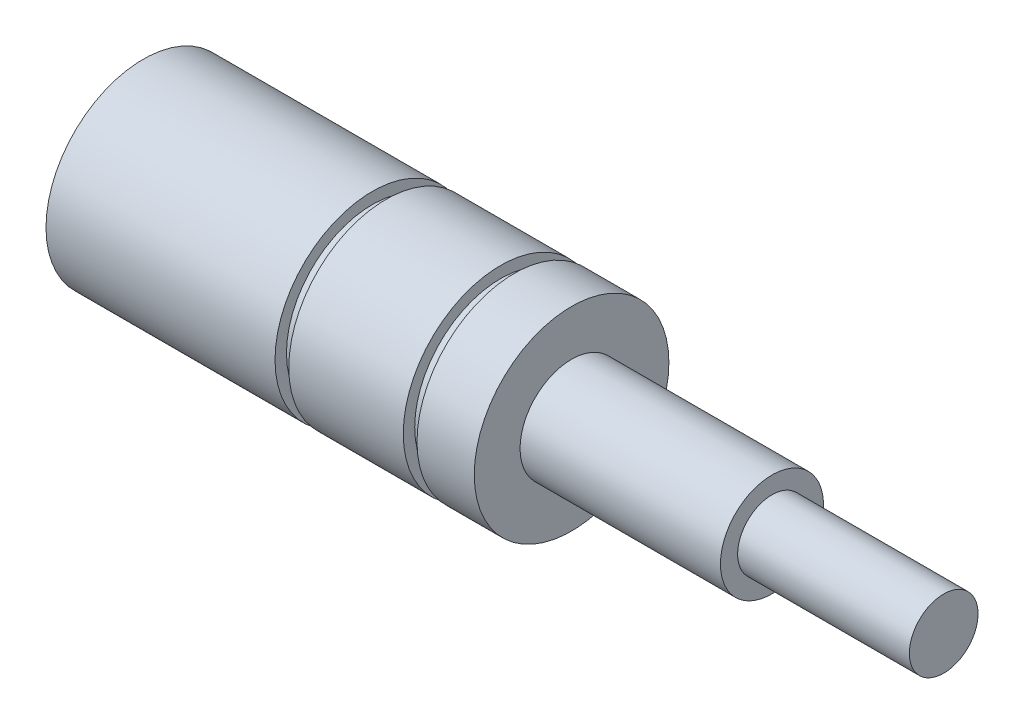
ISO-10303-21;
HEADER;
FILE_DESCRIPTION(('STEP AP214'),'2;1');
FILE_NAME('part.step','',(''),(''),'','','');
FILE_SCHEMA(('AUTOMOTIVE_DESIGN { 1 0 10303 214 1 1 1 1 }'));
ENDSEC;
DATA;
#1=APPLICATION_CONTEXT('core data for automotive mechanical design processes');
#2=APPLICATION_PROTOCOL_DEFINITION('international standard','automotive_design',2000,#1);
#3=PRODUCT_CONTEXT('',#1,'mechanical');
#4=PRODUCT('Part','Part','',(#3));
#5=PRODUCT_RELATED_PRODUCT_CATEGORY('part','',(#4));
#6=PRODUCT_DEFINITION_FORMATION('','',#4);
#7=PRODUCT_DEFINITION_CONTEXT('part definition',#1,'design');
#8=PRODUCT_DEFINITION('design','',#6,#7);
#9=PRODUCT_DEFINITION_SHAPE('','',#8);
#10=(LENGTH_UNIT() NAMED_UNIT(*) SI_UNIT(.MILLI.,.METRE.));
#11=(NAMED_UNIT(*) PLANE_ANGLE_UNIT() SI_UNIT($,.RADIAN.));
#12=(NAMED_UNIT(*) SI_UNIT($,.STERADIAN.) SOLID_ANGLE_UNIT());
#13=UNCERTAINTY_MEASURE_WITH_UNIT(LENGTH_MEASURE(1.E-05),#10,'distance_accuracy_value','');
#14=(GEOMETRIC_REPRESENTATION_CONTEXT(3) GLOBAL_UNCERTAINTY_ASSIGNED_CONTEXT((#13)) GLOBAL_UNIT_ASSIGNED_CONTEXT((#10,
#11,#12)) REPRESENTATION_CONTEXT('',''));
#15=CARTESIAN_POINT('',(0.,0.,0.));
#16=DIRECTION('',(0.,0.,1.));
#17=DIRECTION('',(1.,0.,0.));
#18=AXIS2_PLACEMENT_3D('',#15,#16,#17);
#19=CARTESIAN_POINT('',(-21.4,8.5,0.));
#20=DIRECTION('',(1.,0.,0.));
#21=DIRECTION('',(0.,0.,-1.));
#22=AXIS2_PLACEMENT_3D('',#19,#20,#21);
#23=PLANE('',#22);
#24=CARTESIAN_POINT('',(-21.4,0.,0.));
#25=DIRECTION('',(-1.,0.,0.));
#26=DIRECTION('',(0.,0.,1.));
#27=AXIS2_PLACEMENT_3D('',#24,#25,#26);
#28=CIRCLE('',#27,4.5);
#29=CARTESIAN_POINT('',(-21.4,0.,4.5));
#30=VERTEX_POINT('',#29);
#31=EDGE_CURVE('E10',#30,#30,#28,.T.);
#32=ORIENTED_EDGE('',*,*,#31,.F.);
#33=EDGE_LOOP('',(#32));
#34=FACE_BOUND('',#33,.T.);
#35=CARTESIAN_POINT('',(-21.4,0.,0.));
#36=DIRECTION('',(-1.,0.,0.));
#37=DIRECTION('',(0.,0.,1.));
#38=AXIS2_PLACEMENT_3D('',#35,#36,#37);
#39=CIRCLE('',#38,8.5);
#40=CARTESIAN_POINT('',(-21.4,0.,8.5));
#41=VERTEX_POINT('',#40);
#42=EDGE_CURVE('E104',#41,#41,#39,.T.);
#43=ORIENTED_EDGE('',*,*,#42,.T.);
#44=EDGE_LOOP('',(#43));
#45=FACE_BOUND('',#44,.T.);
#46=ADVANCED_FACE('F37',(#34,#45),#23,.F.);
#47=CARTESIAN_POINT('',(-48.5100507344483,0.,0.));
#48=DIRECTION('',(-1.,0.,0.));
#49=DIRECTION('',(0.,0.,1.));
#50=AXIS2_PLACEMENT_3D('',#47,#48,#49);
#51=CYLINDRICAL_SURFACE('',#50,4.5);
#52=CARTESIAN_POINT('',(0.,0.,0.));
#53=DIRECTION('',(-1.,0.,0.));
#54=DIRECTION('',(0.,0.,1.));
#55=AXIS2_PLACEMENT_3D('',#52,#53,#54);
#56=CIRCLE('',#55,4.5);
#57=CARTESIAN_POINT('',(0.,0.,4.5));
#58=VERTEX_POINT('',#57);
#59=EDGE_CURVE('E44',#58,#58,#56,.T.);
#60=ORIENTED_EDGE('',*,*,#59,.F.);
#61=EDGE_LOOP('',(#60));
#62=FACE_BOUND('',#61,.T.);
#63=ORIENTED_EDGE('',*,*,#31,.T.);
#64=EDGE_LOOP('',(#63));
#65=FACE_BOUND('',#64,.T.);
#66=ADVANCED_FACE('F195',(#62,#65),#51,.F.);
#67=CARTESIAN_POINT('',(0.,4.5,0.));
#68=DIRECTION('',(1.,0.,0.));
#69=DIRECTION('',(0.,0.,-1.));
#70=AXIS2_PLACEMENT_3D('',#67,#68,#69);
#71=PLANE('',#70);
#72=ORIENTED_EDGE('',*,*,#59,.T.);
#73=EDGE_LOOP('',(#72));
#74=FACE_BOUND('',#73,.T.);
#75=ADVANCED_FACE('F190',(#74),#71,.F.);
#76=CARTESIAN_POINT('',(48.5,0.,0.));
#77=DIRECTION('',(-1.,0.,0.));
#78=DIRECTION('',(0.,0.,1.));
#79=AXIS2_PLACEMENT_3D('',#76,#77,#78);
#80=PLANE('',#79);
#81=CARTESIAN_POINT('',(48.5,0.,0.));
#82=DIRECTION('',(-1.,0.,0.));
#83=DIRECTION('',(0.,0.,1.));
#84=AXIS2_PLACEMENT_3D('',#81,#82,#83);
#85=CIRCLE('',#84,3.);
#86=CARTESIAN_POINT('',(48.5,0.,3.));
#87=VERTEX_POINT('',#86);
#88=EDGE_CURVE('E49',#87,#87,#85,.T.);
#89=ORIENTED_EDGE('',*,*,#88,.F.);
#90=EDGE_LOOP('',(#89));
#91=FACE_BOUND('',#90,.T.);
#92=ADVANCED_FACE('F185',(#91),#80,.F.);
#93=CARTESIAN_POINT('',(-48.5100507344483,0.,0.));
#94=DIRECTION('',(-1.,0.,0.));
#95=DIRECTION('',(0.,0.,1.));
#96=AXIS2_PLACEMENT_3D('',#93,#94,#95);
#97=CYLINDRICAL_SURFACE('',#96,3.);
#98=CARTESIAN_POINT('',(33.5,0.,0.));
#99=DIRECTION('',(-1.,0.,0.));
#100=DIRECTION('',(0.,0.,1.));
#101=AXIS2_PLACEMENT_3D('',#98,#99,#100);
#102=CIRCLE('',#101,3.);
#103=CARTESIAN_POINT('',(33.5,0.,3.));
#104=VERTEX_POINT('',#103);
#105=EDGE_CURVE('E54',#104,#104,#102,.T.);
#106=ORIENTED_EDGE('',*,*,#105,.F.);
#107=EDGE_LOOP('',(#106));
#108=FACE_BOUND('',#107,.T.);
#109=ORIENTED_EDGE('',*,*,#88,.T.);
#110=EDGE_LOOP('',(#109));
#111=FACE_BOUND('',#110,.T.);
#112=ADVANCED_FACE('F179',(#108,#111),#97,.T.);
#113=CARTESIAN_POINT('',(33.5,3.,0.));
#114=DIRECTION('',(-1.,0.,0.));
#115=DIRECTION('',(0.,0.,1.));
#116=AXIS2_PLACEMENT_3D('',#113,#114,#115);
#117=PLANE('',#116);
#118=CARTESIAN_POINT('',(33.5,0.,0.));
#119=DIRECTION('',(-1.,0.,0.));
#120=DIRECTION('',(0.,0.,1.));
#121=AXIS2_PLACEMENT_3D('',#118,#119,#120);
#122=CIRCLE('',#121,4.5);
#123=CARTESIAN_POINT('',(33.5,0.,4.5));
#124=VERTEX_POINT('',#123);
#125=EDGE_CURVE('E60',#124,#124,#122,.T.);
#126=ORIENTED_EDGE('',*,*,#125,.F.);
#127=EDGE_LOOP('',(#126));
#128=FACE_BOUND('',#127,.T.);
#129=ORIENTED_EDGE('',*,*,#105,.T.);
#130=EDGE_LOOP('',(#129));
#131=FACE_BOUND('',#130,.T.);
#132=ADVANCED_FACE('F173',(#128,#131),#117,.F.);
#133=CARTESIAN_POINT('',(-48.5100507344483,0.,0.));
#134=DIRECTION('',(-1.,0.,0.));
#135=DIRECTION('',(0.,0.,1.));
#136=AXIS2_PLACEMENT_3D('',#133,#134,#135);
#137=CYLINDRICAL_SURFACE('',#136,4.5);
#138=CARTESIAN_POINT('',(16.,0.,0.));
#139=DIRECTION('',(-1.,0.,0.));
#140=DIRECTION('',(0.,0.,1.));
#141=AXIS2_PLACEMENT_3D('',#138,#139,#140);
#142=CIRCLE('',#141,4.5);
#143=CARTESIAN_POINT('',(16.,0.,4.5));
#144=VERTEX_POINT('',#143);
#145=EDGE_CURVE('E64',#144,#144,#142,.T.);
#146=ORIENTED_EDGE('',*,*,#145,.F.);
#147=EDGE_LOOP('',(#146));
#148=FACE_BOUND('',#147,.T.);
#149=ORIENTED_EDGE('',*,*,#125,.T.);
#150=EDGE_LOOP('',(#149));
#151=FACE_BOUND('',#150,.T.);
#152=ADVANCED_FACE('F167',(#148,#151),#137,.T.);
#153=CARTESIAN_POINT('',(16.,4.5,0.));
#154=DIRECTION('',(-1.,0.,0.));
#155=DIRECTION('',(0.,0.,1.));
#156=AXIS2_PLACEMENT_3D('',#153,#154,#155);
#157=PLANE('',#156);
#158=CARTESIAN_POINT('',(16.,0.,0.));
#159=DIRECTION('',(-1.,0.,0.));
#160=DIRECTION('',(0.,0.,1.));
#161=AXIS2_PLACEMENT_3D('',#158,#159,#160);
#162=CIRCLE('',#161,8.5);
#163=CARTESIAN_POINT('',(16.,0.,8.5));
#164=VERTEX_POINT('',#163);
#165=EDGE_CURVE('E68',#164,#164,#162,.T.);
#166=ORIENTED_EDGE('',*,*,#165,.F.);
#167=EDGE_LOOP('',(#166));
#168=FACE_BOUND('',#167,.T.);
#169=ORIENTED_EDGE('',*,*,#145,.T.);
#170=EDGE_LOOP('',(#169));
#171=FACE_BOUND('',#170,.T.);
#172=ADVANCED_FACE('F161',(#168,#171),#157,.F.);
#173=CARTESIAN_POINT('',(-48.5100507344483,0.,0.));
#174=DIRECTION('',(-1.,0.,0.));
#175=DIRECTION('',(0.,0.,1.));
#176=AXIS2_PLACEMENT_3D('',#173,#174,#175);
#177=CYLINDRICAL_SURFACE('',#176,8.5);
#178=CARTESIAN_POINT('',(11.,0.,0.));
#179=DIRECTION('',(-1.,0.,0.));
#180=DIRECTION('',(0.,0.,1.));
#181=AXIS2_PLACEMENT_3D('',#178,#179,#180);
#182=CIRCLE('',#181,8.5);
#183=CARTESIAN_POINT('',(11.,0.,8.5));
#184=VERTEX_POINT('',#183);
#185=EDGE_CURVE('E72',#184,#184,#182,.T.);
#186=ORIENTED_EDGE('',*,*,#185,.F.);
#187=EDGE_LOOP('',(#186));
#188=FACE_BOUND('',#187,.T.);
#189=ORIENTED_EDGE('',*,*,#165,.T.);
#190=EDGE_LOOP('',(#189));
#191=FACE_BOUND('',#190,.T.);
#192=ADVANCED_FACE('F155',(#188,#191),#177,.T.);
#193=CARTESIAN_POINT('',(11.,8.5,0.));
#194=DIRECTION('',(1.,0.,0.));
#195=DIRECTION('',(0.,0.,-1.));
#196=AXIS2_PLACEMENT_3D('',#193,#194,#195);
#197=PLANE('',#196);
#198=CARTESIAN_POINT('',(11.,0.,0.));
#199=DIRECTION('',(-1.,0.,0.));
#200=DIRECTION('',(0.,0.,1.));
#201=AXIS2_PLACEMENT_3D('',#198,#199,#200);
#202=CIRCLE('',#201,7.5);
#203=CARTESIAN_POINT('',(11.,0.,7.5));
#204=VERTEX_POINT('',#203);
#205=EDGE_CURVE('E76',#204,#204,#202,.T.);
#206=ORIENTED_EDGE('',*,*,#205,.F.);
#207=EDGE_LOOP('',(#206));
#208=FACE_BOUND('',#207,.T.);
#209=ORIENTED_EDGE('',*,*,#185,.T.);
#210=EDGE_LOOP('',(#209));
#211=FACE_BOUND('',#210,.T.);
#212=ADVANCED_FACE('F149',(#208,#211),#197,.F.);
#213=CARTESIAN_POINT('',(-48.5100507344483,0.,0.));
#214=DIRECTION('',(-1.,0.,0.));
#215=DIRECTION('',(0.,0.,1.));
#216=AXIS2_PLACEMENT_3D('',#213,#214,#215);
#217=CYLINDRICAL_SURFACE('',#216,7.5);
#218=CARTESIAN_POINT('',(9.8,0.,0.));
#219=DIRECTION('',(-1.,0.,0.));
#220=DIRECTION('',(0.,0.,1.));
#221=AXIS2_PLACEMENT_3D('',#218,#219,#220);
#222=CIRCLE('',#221,7.5);
#223=CARTESIAN_POINT('',(9.8,0.,7.5));
#224=VERTEX_POINT('',#223);
#225=EDGE_CURVE('E80',#224,#224,#222,.T.);
#226=ORIENTED_EDGE('',*,*,#225,.F.);
#227=EDGE_LOOP('',(#226));
#228=FACE_BOUND('',#227,.T.);
#229=ORIENTED_EDGE('',*,*,#205,.T.);
#230=EDGE_LOOP('',(#229));
#231=FACE_BOUND('',#230,.T.);
#232=ADVANCED_FACE('F143',(#228,#231),#217,.T.);
#233=CARTESIAN_POINT('',(9.8,7.5,0.));
#234=DIRECTION('',(-1.,0.,0.));
#235=DIRECTION('',(0.,0.,1.));
#236=AXIS2_PLACEMENT_3D('',#233,#234,#235);
#237=PLANE('',#236);
#238=CARTESIAN_POINT('',(9.8,0.,0.));
#239=DIRECTION('',(-1.,0.,0.));
#240=DIRECTION('',(0.,0.,1.));
#241=AXIS2_PLACEMENT_3D('',#238,#239,#240);
#242=CIRCLE('',#241,8.5);
#243=CARTESIAN_POINT('',(9.8,0.,8.5));
#244=VERTEX_POINT('',#243);
#245=EDGE_CURVE('E84',#244,#244,#242,.T.);
#246=ORIENTED_EDGE('',*,*,#245,.F.);
#247=EDGE_LOOP('',(#246));
#248=FACE_BOUND('',#247,.T.);
#249=ORIENTED_EDGE('',*,*,#225,.T.);
#250=EDGE_LOOP('',(#249));
#251=FACE_BOUND('',#250,.T.);
#252=ADVANCED_FACE('F137',(#248,#251),#237,.F.);
#253=CARTESIAN_POINT('',(-48.5100507344483,0.,0.));
#254=DIRECTION('',(-1.,0.,0.));
#255=DIRECTION('',(0.,0.,1.));
#256=AXIS2_PLACEMENT_3D('',#253,#254,#255);
#257=CYLINDRICAL_SURFACE('',#256,8.5);
#258=CARTESIAN_POINT('',(-0.199999999999999,0.,0.));
#259=DIRECTION('',(-1.,0.,0.));
#260=DIRECTION('',(0.,0.,1.));
#261=AXIS2_PLACEMENT_3D('',#258,#259,#260);
#262=CIRCLE('',#261,8.5);
#263=CARTESIAN_POINT('',(-0.199999999999999,0.,8.5));
#264=VERTEX_POINT('',#263);
#265=EDGE_CURVE('E88',#264,#264,#262,.T.);
#266=ORIENTED_EDGE('',*,*,#265,.F.);
#267=EDGE_LOOP('',(#266));
#268=FACE_BOUND('',#267,.T.);
#269=ORIENTED_EDGE('',*,*,#245,.T.);
#270=EDGE_LOOP('',(#269));
#271=FACE_BOUND('',#270,.T.);
#272=ADVANCED_FACE('F131',(#268,#271),#257,.T.);
#273=CARTESIAN_POINT('',(-0.2,8.5,0.));
#274=DIRECTION('',(1.,0.,0.));
#275=DIRECTION('',(0.,0.,-1.));
#276=AXIS2_PLACEMENT_3D('',#273,#274,#275);
#277=PLANE('',#276);
#278=CARTESIAN_POINT('',(-0.199999999999999,0.,0.));
#279=DIRECTION('',(-1.,0.,0.));
#280=DIRECTION('',(0.,0.,1.));
#281=AXIS2_PLACEMENT_3D('',#278,#279,#280);
#282=CIRCLE('',#281,7.5);
#283=CARTESIAN_POINT('',(-0.199999999999999,0.,7.5));
#284=VERTEX_POINT('',#283);
#285=EDGE_CURVE('E92',#284,#284,#282,.T.);
#286=ORIENTED_EDGE('',*,*,#285,.F.);
#287=EDGE_LOOP('',(#286));
#288=FACE_BOUND('',#287,.T.);
#289=ORIENTED_EDGE('',*,*,#265,.T.);
#290=EDGE_LOOP('',(#289));
#291=FACE_BOUND('',#290,.T.);
#292=ADVANCED_FACE('F125',(#288,#291),#277,.F.);
#293=CARTESIAN_POINT('',(-48.5100507344483,0.,0.));
#294=DIRECTION('',(-1.,0.,0.));
#295=DIRECTION('',(0.,0.,1.));
#296=AXIS2_PLACEMENT_3D('',#293,#294,#295);
#297=CYLINDRICAL_SURFACE('',#296,7.5);
#298=CARTESIAN_POINT('',(-1.4,0.,0.));
#299=DIRECTION('',(-1.,0.,0.));
#300=DIRECTION('',(0.,0.,1.));
#301=AXIS2_PLACEMENT_3D('',#298,#299,#300);
#302=CIRCLE('',#301,7.5);
#303=CARTESIAN_POINT('',(-1.4,0.,7.5));
#304=VERTEX_POINT('',#303);
#305=EDGE_CURVE('E96',#304,#304,#302,.T.);
#306=ORIENTED_EDGE('',*,*,#305,.F.);
#307=EDGE_LOOP('',(#306));
#308=FACE_BOUND('',#307,.T.);
#309=ORIENTED_EDGE('',*,*,#285,.T.);
#310=EDGE_LOOP('',(#309));
#311=FACE_BOUND('',#310,.T.);
#312=ADVANCED_FACE('F119',(#308,#311),#297,.T.);
#313=CARTESIAN_POINT('',(-1.4,7.5,0.));
#314=DIRECTION('',(-1.,0.,0.));
#315=DIRECTION('',(0.,0.,1.));
#316=AXIS2_PLACEMENT_3D('',#313,#314,#315);
#317=PLANE('',#316);
#318=CARTESIAN_POINT('',(-1.4,0.,0.));
#319=DIRECTION('',(-1.,0.,0.));
#320=DIRECTION('',(0.,0.,1.));
#321=AXIS2_PLACEMENT_3D('',#318,#319,#320);
#322=CIRCLE('',#321,8.5);
#323=CARTESIAN_POINT('',(-1.4,0.,8.5));
#324=VERTEX_POINT('',#323);
#325=EDGE_CURVE('E100',#324,#324,#322,.T.);
#326=ORIENTED_EDGE('',*,*,#325,.F.);
#327=EDGE_LOOP('',(#326));
#328=FACE_BOUND('',#327,.T.);
#329=ORIENTED_EDGE('',*,*,#305,.T.);
#330=EDGE_LOOP('',(#329));
#331=FACE_BOUND('',#330,.T.);
#332=ADVANCED_FACE('F113',(#328,#331),#317,.F.);
#333=CARTESIAN_POINT('',(-48.5100507344483,0.,0.));
#334=DIRECTION('',(-1.,0.,0.));
#335=DIRECTION('',(0.,0.,1.));
#336=AXIS2_PLACEMENT_3D('',#333,#334,#335);
#337=CYLINDRICAL_SURFACE('',#336,8.5);
#338=ORIENTED_EDGE('',*,*,#42,.F.);
#339=EDGE_LOOP('',(#338));
#340=FACE_BOUND('',#339,.T.);
#341=ORIENTED_EDGE('',*,*,#325,.T.);
#342=EDGE_LOOP('',(#341));
#343=FACE_BOUND('',#342,.T.);
#344=ADVANCED_FACE('F110',(#340,#343),#337,.T.);
#345=CLOSED_SHELL('',(#46,#66,#75,#92,#112,#132,#152,#172,#192,#212,#232,#252,#272,#292,#312,
#332,#344));
#346=MANIFOLD_SOLID_BREP('B2',#345);
#347=ADVANCED_BREP_SHAPE_REPRESENTATION('',(#18,#346),#14);
#348=SHAPE_DEFINITION_REPRESENTATION(#9,#347);
ENDSEC;
END-ISO-10303-21;
